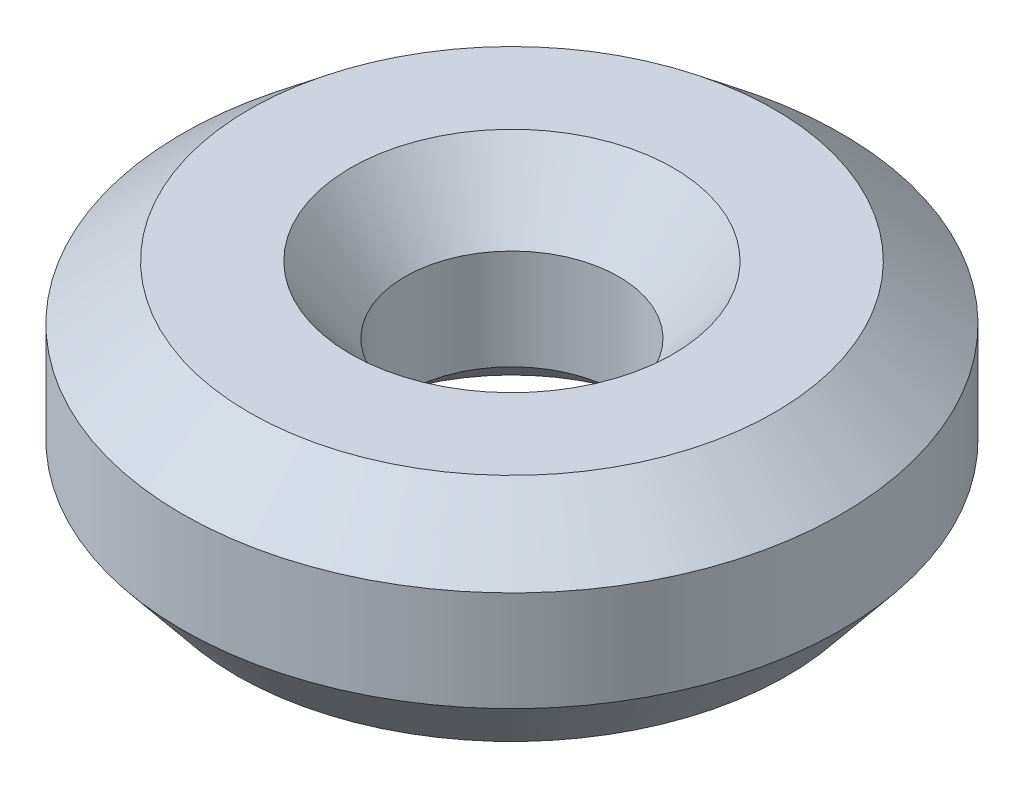
ISO-10303-21;
HEADER;
FILE_DESCRIPTION(('STEP AP214'),'2;1');
FILE_NAME('part.step','',(''),(''),'','','');
FILE_SCHEMA(('AUTOMOTIVE_DESIGN { 1 0 10303 214 1 1 1 1 }'));
ENDSEC;
DATA;
#1=APPLICATION_CONTEXT('core data for automotive mechanical design processes');
#2=APPLICATION_PROTOCOL_DEFINITION('international standard','automotive_design',2000,#1);
#3=PRODUCT_CONTEXT('',#1,'mechanical');
#4=PRODUCT('Part','Part','',(#3));
#5=PRODUCT_RELATED_PRODUCT_CATEGORY('part','',(#4));
#6=PRODUCT_DEFINITION_FORMATION('','',#4);
#7=PRODUCT_DEFINITION_CONTEXT('part definition',#1,'design');
#8=PRODUCT_DEFINITION('design','',#6,#7);
#9=PRODUCT_DEFINITION_SHAPE('','',#8);
#10=(LENGTH_UNIT() NAMED_UNIT(*) SI_UNIT(.MILLI.,.METRE.));
#11=(NAMED_UNIT(*) PLANE_ANGLE_UNIT() SI_UNIT($,.RADIAN.));
#12=(NAMED_UNIT(*) SI_UNIT($,.STERADIAN.) SOLID_ANGLE_UNIT());
#13=UNCERTAINTY_MEASURE_WITH_UNIT(LENGTH_MEASURE(1.E-05),#10,'distance_accuracy_value','');
#14=(GEOMETRIC_REPRESENTATION_CONTEXT(3) GLOBAL_UNCERTAINTY_ASSIGNED_CONTEXT((#13)) GLOBAL_UNIT_ASSIGNED_CONTEXT((#10,
#11,#12)) REPRESENTATION_CONTEXT('',''));
#15=CARTESIAN_POINT('',(0.,0.,0.));
#16=DIRECTION('',(0.,0.,1.));
#17=DIRECTION('',(1.,0.,0.));
#18=AXIS2_PLACEMENT_3D('',#15,#16,#17);
#19=CARTESIAN_POINT('',(0.,6.72615004905455,0.));
#20=DIRECTION('',(0.,-1.,0.));
#21=DIRECTION('',(0.,0.,-1.));
#22=AXIS2_PLACEMENT_3D('',#19,#20,#21);
#23=CYLINDRICAL_SURFACE('',#22,10.);
#24=CARTESIAN_POINT('',(0.,2.03153903639055,0.));
#25=DIRECTION('',(0.,1.,0.));
#26=DIRECTION('',(0.,0.,1.));
#27=AXIS2_PLACEMENT_3D('',#24,#25,#26);
#28=CIRCLE('',#27,10.);
#29=CARTESIAN_POINT('',(0.,2.03153903639055,10.));
#30=VERTEX_POINT('',#29);
#31=EDGE_CURVE('E10',#30,#30,#28,.T.);
#32=ORIENTED_EDGE('',*,*,#31,.T.);
#33=EDGE_LOOP('',(#32));
#34=FACE_BOUND('',#33,.T.);
#35=CARTESIAN_POINT('',(0.,5.07357480792065,0.));
#36=DIRECTION('',(0.,1.,0.));
#37=DIRECTION('',(0.,0.,1.));
#38=AXIS2_PLACEMENT_3D('',#35,#36,#37);
#39=CIRCLE('',#38,10.);
#40=CARTESIAN_POINT('',(0.,5.07357480792065,10.));
#41=VERTEX_POINT('',#40);
#42=EDGE_CURVE('E50',#41,#41,#39,.F.);
#43=ORIENTED_EDGE('',*,*,#42,.T.);
#44=EDGE_LOOP('',(#43));
#45=FACE_BOUND('',#44,.T.);
#46=ADVANCED_FACE('F39',(#34,#45),#23,.T.);
#47=CARTESIAN_POINT('',(0.,6.72615004905455,0.));
#48=DIRECTION('',(0.,1.,0.));
#49=DIRECTION('',(0.,0.,1.));
#50=AXIS2_PLACEMENT_3D('',#47,#48,#49);
#51=PLANE('',#50);
#52=CARTESIAN_POINT('',(0.,6.72615004905455,0.));
#53=DIRECTION('',(0.,1.,0.));
#54=DIRECTION('',(0.,0.,1.));
#55=AXIS2_PLACEMENT_3D('',#52,#53,#54);
#56=CIRCLE('',#55,4.89501431432154);
#57=CARTESIAN_POINT('',(0.,6.72615004905455,4.89501431432154));
#58=VERTEX_POINT('',#57);
#59=EDGE_CURVE('E58',#58,#58,#56,.F.);
#60=ORIENTED_EDGE('',*,*,#59,.T.);
#61=EDGE_LOOP('',(#60));
#62=FACE_BOUND('',#61,.T.);
#63=CARTESIAN_POINT('',(0.,6.72615004905455,0.));
#64=DIRECTION('',(0.,1.,0.));
#65=DIRECTION('',(0.,0.,1.));
#66=AXIS2_PLACEMENT_3D('',#63,#64,#65);
#67=CIRCLE('',#66,7.96846096360946);
#68=CARTESIAN_POINT('',(0.,6.72615004905455,7.96846096360946));
#69=VERTEX_POINT('',#68);
#70=EDGE_CURVE('E61',#69,#69,#67,.T.);
#71=ORIENTED_EDGE('',*,*,#70,.T.);
#72=EDGE_LOOP('',(#71));
#73=FACE_BOUND('',#72,.T.);
#74=ADVANCED_FACE('F88',(#62,#73),#51,.T.);
#75=CARTESIAN_POINT('',(0.,0.,0.));
#76=DIRECTION('',(0.,1.,0.));
#77=DIRECTION('',(0.,0.,1.));
#78=AXIS2_PLACEMENT_3D('',#75,#76,#77);
#79=PLANE('',#78);
#80=CARTESIAN_POINT('',(0.,0.,0.));
#81=DIRECTION('',(0.,1.,0.));
#82=DIRECTION('',(0.,0.,1.));
#83=AXIS2_PLACEMENT_3D('',#80,#81,#82);
#84=CIRCLE('',#83,5.27397810957818);
#85=CARTESIAN_POINT('',(0.,0.,5.27397810957818));
#86=VERTEX_POINT('',#85);
#87=EDGE_CURVE('E51',#86,#86,#84,.T.);
#88=ORIENTED_EDGE('',*,*,#87,.T.);
#89=EDGE_LOOP('',(#88));
#90=FACE_BOUND('',#89,.T.);
#91=CARTESIAN_POINT('',(0.,0.,0.));
#92=DIRECTION('',(0.,1.,0.));
#93=DIRECTION('',(0.,0.,1.));
#94=AXIS2_PLACEMENT_3D('',#91,#92,#93);
#95=CIRCLE('',#94,8.34742475886611);
#96=CARTESIAN_POINT('',(0.,0.,8.34742475886611));
#97=VERTEX_POINT('',#96);
#98=EDGE_CURVE('E54',#97,#97,#95,.F.);
#99=ORIENTED_EDGE('',*,*,#98,.T.);
#100=EDGE_LOOP('',(#99));
#101=FACE_BOUND('',#100,.T.);
#102=ADVANCED_FACE('F83',(#90,#101),#79,.F.);
#103=CARTESIAN_POINT('',(0.,6.72615004905455,0.));
#104=DIRECTION('',(0.,-1.,0.));
#105=DIRECTION('',(0.,0.,-1.));
#106=AXIS2_PLACEMENT_3D('',#103,#104,#105);
#107=CYLINDRICAL_SURFACE('',#106,3.24243907318764);
#108=CARTESIAN_POINT('',(0.,4.69461101266401,0.));
#109=DIRECTION('',(0.,1.,0.));
#110=DIRECTION('',(0.,0.,1.));
#111=AXIS2_PLACEMENT_3D('',#108,#109,#110);
#112=CIRCLE('',#111,3.24243907318764);
#113=CARTESIAN_POINT('',(0.,4.69461101266401,3.24243907318764));
#114=VERTEX_POINT('',#113);
#115=EDGE_CURVE('E67',#114,#114,#112,.T.);
#116=ORIENTED_EDGE('',*,*,#115,.T.);
#117=EDGE_LOOP('',(#116));
#118=FACE_BOUND('',#117,.T.);
#119=CARTESIAN_POINT('',(0.,1.65257524113389,0.));
#120=DIRECTION('',(0.,1.,0.));
#121=DIRECTION('',(0.,0.,1.));
#122=AXIS2_PLACEMENT_3D('',#119,#120,#121);
#123=CIRCLE('',#122,3.24243907318764);
#124=CARTESIAN_POINT('',(0.,1.65257524113389,3.24243907318764));
#125=VERTEX_POINT('',#124);
#126=EDGE_CURVE('E69',#125,#125,#123,.F.);
#127=ORIENTED_EDGE('',*,*,#126,.T.);
#128=EDGE_LOOP('',(#127));
#129=FACE_BOUND('',#128,.T.);
#130=ADVANCED_FACE('F71',(#118,#129),#107,.F.);
#131=CARTESIAN_POINT('',(0.,4.69461101266401,0.));
#132=DIRECTION('',(0.,1.,0.));
#133=DIRECTION('',(0.,0.,1.));
#134=AXIS2_PLACEMENT_3D('',#131,#132,#133);
#135=CONICAL_SURFACE('',#134,3.24243907318764,0.68289439295431);
#136=ORIENTED_EDGE('',*,*,#59,.F.);
#137=EDGE_LOOP('',(#136));
#138=FACE_BOUND('',#137,.T.);
#139=ORIENTED_EDGE('',*,*,#115,.F.);
#140=EDGE_LOOP('',(#139));
#141=FACE_BOUND('',#140,.T.);
#142=ADVANCED_FACE('F77',(#138,#141),#135,.F.);
#143=CARTESIAN_POINT('',(0.,0.,0.));
#144=DIRECTION('',(0.,-1.,0.));
#145=DIRECTION('',(0.,0.,-1.));
#146=AXIS2_PLACEMENT_3D('',#143,#144,#145);
#147=CONICAL_SURFACE('',#146,5.27397810957818,0.887901933840586);
#148=ORIENTED_EDGE('',*,*,#126,.F.);
#149=EDGE_LOOP('',(#148));
#150=FACE_BOUND('',#149,.T.);
#151=ORIENTED_EDGE('',*,*,#87,.F.);
#152=EDGE_LOOP('',(#151));
#153=FACE_BOUND('',#152,.T.);
#154=ADVANCED_FACE('F73',(#150,#153),#147,.F.);
#155=CARTESIAN_POINT('',(0.,2.03153903639055,0.));
#156=DIRECTION('',(0.,1.,0.));
#157=DIRECTION('',(0.,0.,1.));
#158=AXIS2_PLACEMENT_3D('',#155,#156,#157);
#159=CONICAL_SURFACE('',#158,10.,0.682894392954309);
#160=ORIENTED_EDGE('',*,*,#98,.F.);
#161=EDGE_LOOP('',(#160));
#162=FACE_BOUND('',#161,.T.);
#163=ORIENTED_EDGE('',*,*,#31,.F.);
#164=EDGE_LOOP('',(#163));
#165=FACE_BOUND('',#164,.T.);
#166=ADVANCED_FACE('F76',(#162,#165),#159,.T.);
#167=CARTESIAN_POINT('',(0.,6.72615004905455,0.));
#168=DIRECTION('',(0.,-1.,0.));
#169=DIRECTION('',(0.,0.,-1.));
#170=AXIS2_PLACEMENT_3D('',#167,#168,#169);
#171=CONICAL_SURFACE('',#170,7.96846096360946,0.887901933840588);
#172=ORIENTED_EDGE('',*,*,#42,.F.);
#173=EDGE_LOOP('',(#172));
#174=FACE_BOUND('',#173,.T.);
#175=ORIENTED_EDGE('',*,*,#70,.F.);
#176=EDGE_LOOP('',(#175));
#177=FACE_BOUND('',#176,.T.);
#178=ADVANCED_FACE('F45',(#174,#177),#171,.T.);
#179=CLOSED_SHELL('',(#46,#74,#102,#130,#142,#154,#166,#178));
#180=MANIFOLD_SOLID_BREP('B2',#179);
#181=ADVANCED_BREP_SHAPE_REPRESENTATION('',(#18,#180),#14);
#182=SHAPE_DEFINITION_REPRESENTATION(#9,#181);
ENDSEC;
END-ISO-10303-21;
